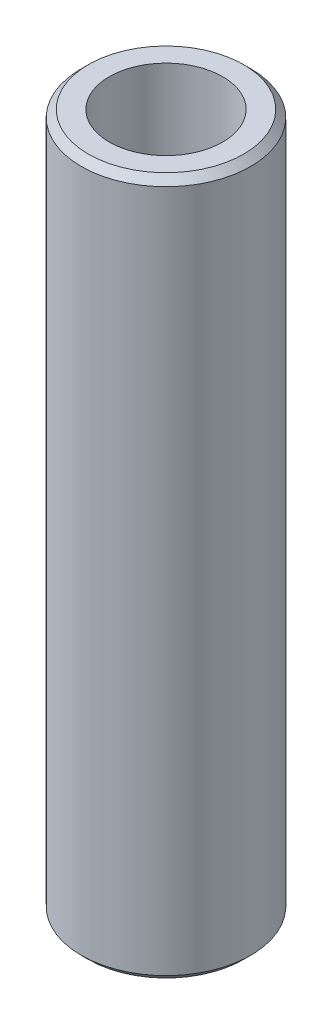
ISO-10303-21;
HEADER;
FILE_DESCRIPTION(('STEP AP214'),'2;1');
FILE_NAME('part.step','',(''),(''),'','','');
FILE_SCHEMA(('AUTOMOTIVE_DESIGN { 1 0 10303 214 1 1 1 1 }'));
ENDSEC;
DATA;
#1=APPLICATION_CONTEXT('core data for automotive mechanical design processes');
#2=APPLICATION_PROTOCOL_DEFINITION('international standard','automotive_design',2000,#1);
#3=PRODUCT_CONTEXT('',#1,'mechanical');
#4=PRODUCT('Part','Part','',(#3));
#5=PRODUCT_RELATED_PRODUCT_CATEGORY('part','',(#4));
#6=PRODUCT_DEFINITION_FORMATION('','',#4);
#7=PRODUCT_DEFINITION_CONTEXT('part definition',#1,'design');
#8=PRODUCT_DEFINITION('design','',#6,#7);
#9=PRODUCT_DEFINITION_SHAPE('','',#8);
#10=(LENGTH_UNIT() NAMED_UNIT(*) SI_UNIT(.MILLI.,.METRE.));
#11=(NAMED_UNIT(*) PLANE_ANGLE_UNIT() SI_UNIT($,.RADIAN.));
#12=(NAMED_UNIT(*) SI_UNIT($,.STERADIAN.) SOLID_ANGLE_UNIT());
#13=UNCERTAINTY_MEASURE_WITH_UNIT(LENGTH_MEASURE(1.E-05),#10,'distance_accuracy_value','');
#14=(GEOMETRIC_REPRESENTATION_CONTEXT(3) GLOBAL_UNCERTAINTY_ASSIGNED_CONTEXT((#13)) GLOBAL_UNIT_ASSIGNED_CONTEXT((#10,
#11,#12)) REPRESENTATION_CONTEXT('',''));
#15=CARTESIAN_POINT('',(0.,0.,0.));
#16=DIRECTION('',(0.,0.,1.));
#17=DIRECTION('',(1.,0.,0.));
#18=AXIS2_PLACEMENT_3D('',#15,#16,#17);
#19=CARTESIAN_POINT('',(0.,432.197386778043,0.));
#20=DIRECTION('',(0.,-1.,0.));
#21=DIRECTION('',(0.,0.,-1.));
#22=AXIS2_PLACEMENT_3D('',#19,#20,#21);
#23=CYLINDRICAL_SURFACE('',#22,52.5);
#24=CARTESIAN_POINT('',(0.,427.797103349192,0.));
#25=DIRECTION('',(0.,1.,0.));
#26=DIRECTION('',(0.,0.,1.));
#27=AXIS2_PLACEMENT_3D('',#24,#25,#26);
#28=CIRCLE('',#27,52.5);
#29=CARTESIAN_POINT('',(0.,427.797103349192,52.5));
#30=VERTEX_POINT('',#29);
#31=EDGE_CURVE('E50',#30,#30,#28,.F.);
#32=ORIENTED_EDGE('',*,*,#31,.T.);
#33=EDGE_LOOP('',(#32));
#34=FACE_BOUND('',#33,.T.);
#35=CARTESIAN_POINT('',(0.,4.40028342885096,0.));
#36=DIRECTION('',(0.,1.,0.));
#37=DIRECTION('',(0.,0.,1.));
#38=AXIS2_PLACEMENT_3D('',#35,#36,#37);
#39=CIRCLE('',#38,52.5);
#40=CARTESIAN_POINT('',(0.,4.40028342885096,52.5));
#41=VERTEX_POINT('',#40);
#42=EDGE_CURVE('E51',#41,#41,#39,.T.);
#43=ORIENTED_EDGE('',*,*,#42,.T.);
#44=EDGE_LOOP('',(#43));
#45=FACE_BOUND('',#44,.T.);
#46=ADVANCED_FACE('F39',(#34,#45),#23,.T.);
#47=CARTESIAN_POINT('',(0.,432.197386778043,0.));
#48=DIRECTION('',(0.,1.,0.));
#49=DIRECTION('',(0.,0.,1.));
#50=AXIS2_PLACEMENT_3D('',#47,#48,#49);
#51=PLANE('',#50);
#52=CARTESIAN_POINT('',(0.,432.197386778043,0.));
#53=DIRECTION('',(0.,1.,0.));
#54=DIRECTION('',(0.,0.,1.));
#55=AXIS2_PLACEMENT_3D('',#52,#53,#54);
#56=CIRCLE('',#55,48.099716571149);
#57=CARTESIAN_POINT('',(0.,432.197386778043,48.099716571149));
#58=VERTEX_POINT('',#57);
#59=EDGE_CURVE('E54',#58,#58,#56,.T.);
#60=ORIENTED_EDGE('',*,*,#59,.T.);
#61=EDGE_LOOP('',(#60));
#62=FACE_BOUND('',#61,.T.);
#63=CARTESIAN_POINT('',(0.,432.197386778043,0.));
#64=DIRECTION('',(0.,1.,0.));
#65=DIRECTION('',(0.,0.,1.));
#66=AXIS2_PLACEMENT_3D('',#63,#64,#65);
#67=CIRCLE('',#66,35.1373571267529);
#68=CARTESIAN_POINT('',(0.,432.197386778043,35.1373571267529));
#69=VERTEX_POINT('',#68);
#70=EDGE_CURVE('E58',#69,#69,#67,.T.);
#71=ORIENTED_EDGE('',*,*,#70,.F.);
#72=EDGE_LOOP('',(#71));
#73=FACE_BOUND('',#72,.T.);
#74=ADVANCED_FACE('F69',(#62,#73),#51,.T.);
#75=CARTESIAN_POINT('',(0.,0.,0.));
#76=DIRECTION('',(0.,1.,0.));
#77=DIRECTION('',(0.,0.,1.));
#78=AXIS2_PLACEMENT_3D('',#75,#76,#77);
#79=PLANE('',#78);
#80=CARTESIAN_POINT('',(0.,0.,0.));
#81=DIRECTION('',(0.,1.,0.));
#82=DIRECTION('',(0.,0.,1.));
#83=AXIS2_PLACEMENT_3D('',#80,#81,#82);
#84=CIRCLE('',#83,48.099716571149);
#85=CARTESIAN_POINT('',(0.,0.,48.099716571149));
#86=VERTEX_POINT('',#85);
#87=EDGE_CURVE('E10',#86,#86,#84,.F.);
#88=ORIENTED_EDGE('',*,*,#87,.T.);
#89=EDGE_LOOP('',(#88));
#90=FACE_BOUND('',#89,.T.);
#91=CARTESIAN_POINT('',(0.,0.,0.));
#92=DIRECTION('',(0.,1.,0.));
#93=DIRECTION('',(0.,0.,1.));
#94=AXIS2_PLACEMENT_3D('',#91,#92,#93);
#95=CIRCLE('',#94,35.1373571267529);
#96=CARTESIAN_POINT('',(0.,0.,35.1373571267529));
#97=VERTEX_POINT('',#96);
#98=EDGE_CURVE('E63',#97,#97,#95,.T.);
#99=ORIENTED_EDGE('',*,*,#98,.T.);
#100=EDGE_LOOP('',(#99));
#101=FACE_BOUND('',#100,.T.);
#102=ADVANCED_FACE('F75',(#90,#101),#79,.F.);
#103=CARTESIAN_POINT('',(0.,432.197386778043,0.));
#104=DIRECTION('',(0.,-1.,0.));
#105=DIRECTION('',(0.,0.,-1.));
#106=AXIS2_PLACEMENT_3D('',#103,#104,#105);
#107=CYLINDRICAL_SURFACE('',#106,35.1373571267529);
#108=ORIENTED_EDGE('',*,*,#70,.T.);
#109=EDGE_LOOP('',(#108));
#110=FACE_BOUND('',#109,.T.);
#111=ORIENTED_EDGE('',*,*,#98,.F.);
#112=EDGE_LOOP('',(#111));
#113=FACE_BOUND('',#112,.T.);
#114=ADVANCED_FACE('F70',(#110,#113),#107,.F.);
#115=CARTESIAN_POINT('',(0.,432.197386778043,0.));
#116=DIRECTION('',(0.,-1.,0.));
#117=DIRECTION('',(0.,0.,-1.));
#118=AXIS2_PLACEMENT_3D('',#115,#116,#117);
#119=CONICAL_SURFACE('',#118,48.099716571149,0.785398163397443);
#120=ORIENTED_EDGE('',*,*,#31,.F.);
#121=EDGE_LOOP('',(#120));
#122=FACE_BOUND('',#121,.T.);
#123=ORIENTED_EDGE('',*,*,#59,.F.);
#124=EDGE_LOOP('',(#123));
#125=FACE_BOUND('',#124,.T.);
#126=ADVANCED_FACE('F81',(#122,#125),#119,.T.);
#127=CARTESIAN_POINT('',(0.,4.40028342885096,0.));
#128=DIRECTION('',(0.,1.,0.));
#129=DIRECTION('',(0.,0.,1.));
#130=AXIS2_PLACEMENT_3D('',#127,#128,#129);
#131=CONICAL_SURFACE('',#130,52.5,0.785398163397455);
#132=ORIENTED_EDGE('',*,*,#87,.F.);
#133=EDGE_LOOP('',(#132));
#134=FACE_BOUND('',#133,.T.);
#135=ORIENTED_EDGE('',*,*,#42,.F.);
#136=EDGE_LOOP('',(#135));
#137=FACE_BOUND('',#136,.T.);
#138=ADVANCED_FACE('F45',(#134,#137),#131,.T.);
#139=CLOSED_SHELL('',(#46,#74,#102,#114,#126,#138));
#140=MANIFOLD_SOLID_BREP('B2',#139);
#141=ADVANCED_BREP_SHAPE_REPRESENTATION('',(#18,#140),#14);
#142=SHAPE_DEFINITION_REPRESENTATION(#9,#141);
ENDSEC;
END-ISO-10303-21;
